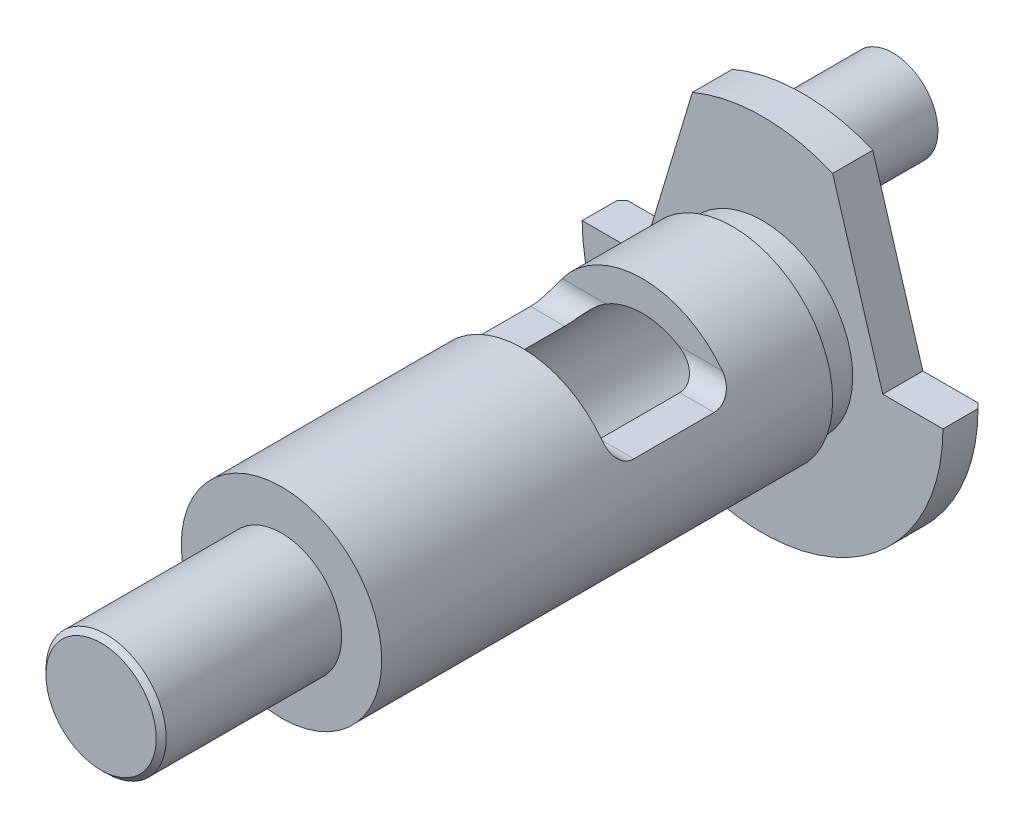
ISO-10303-21;
HEADER;
FILE_DESCRIPTION(('STEP AP214'),'2;1');
FILE_NAME('part.step','',(''),(''),'','','');
FILE_SCHEMA(('AUTOMOTIVE_DESIGN { 1 0 10303 214 1 1 1 1 }'));
ENDSEC;
DATA;
#1=APPLICATION_CONTEXT('core data for automotive mechanical design processes');
#2=APPLICATION_PROTOCOL_DEFINITION('international standard','automotive_design',2000,#1);
#3=PRODUCT_CONTEXT('',#1,'mechanical');
#4=PRODUCT('Part','Part','',(#3));
#5=PRODUCT_RELATED_PRODUCT_CATEGORY('part','',(#4));
#6=PRODUCT_DEFINITION_FORMATION('','',#4);
#7=PRODUCT_DEFINITION_CONTEXT('part definition',#1,'design');
#8=PRODUCT_DEFINITION('design','',#6,#7);
#9=PRODUCT_DEFINITION_SHAPE('','',#8);
#10=(LENGTH_UNIT() NAMED_UNIT(*) SI_UNIT(.MILLI.,.METRE.));
#11=(NAMED_UNIT(*) PLANE_ANGLE_UNIT() SI_UNIT($,.RADIAN.));
#12=(NAMED_UNIT(*) SI_UNIT($,.STERADIAN.) SOLID_ANGLE_UNIT());
#13=UNCERTAINTY_MEASURE_WITH_UNIT(LENGTH_MEASURE(1.E-05),#10,'distance_accuracy_value','');
#14=(GEOMETRIC_REPRESENTATION_CONTEXT(3) GLOBAL_UNCERTAINTY_ASSIGNED_CONTEXT((#13)) GLOBAL_UNIT_ASSIGNED_CONTEXT((#10,
#11,#12)) REPRESENTATION_CONTEXT('',''));
#15=CARTESIAN_POINT('',(0.,0.,0.));
#16=DIRECTION('',(0.,0.,1.));
#17=DIRECTION('',(1.,0.,0.));
#18=AXIS2_PLACEMENT_3D('',#15,#16,#17);
#19=CARTESIAN_POINT('',(0.,8.99999999999999,4.));
#20=DIRECTION('',(0.,0.,1.));
#21=DIRECTION('',(0.,-1.,0.));
#22=AXIS2_PLACEMENT_3D('',#19,#20,#21);
#23=PLANE('',#22);
#24=CARTESIAN_POINT('',(0.,0.,4.));
#25=DIRECTION('',(0.,0.,-1.));
#26=DIRECTION('',(0.,1.,0.));
#27=AXIS2_PLACEMENT_3D('',#24,#25,#26);
#28=CIRCLE('',#27,8.99999999999999);
#29=CARTESIAN_POINT('',(0.,8.99999999999999,4.));
#30=VERTEX_POINT('',#29);
#31=EDGE_CURVE('E188',#30,#30,#28,.T.);
#32=ORIENTED_EDGE('',*,*,#31,.T.);
#33=EDGE_LOOP('',(#32));
#34=FACE_BOUND('',#33,.T.);
#35=CARTESIAN_POINT('',(0.,0.,4.));
#36=DIRECTION('',(0.,0.,-1.));
#37=DIRECTION('',(0.,1.,0.));
#38=AXIS2_PLACEMENT_3D('',#35,#36,#37);
#39=CIRCLE('',#38,18.);
#40=CARTESIAN_POINT('',(18.,0.,4.));
#41=VERTEX_POINT('',#40);
#42=CARTESIAN_POINT('',(-18.,0.,4.));
#43=VERTEX_POINT('',#42);
#44=EDGE_CURVE('E181',#41,#43,#39,.T.);
#45=ORIENTED_EDGE('',*,*,#44,.F.);
#46=DIRECTION('',(-1.,0.,0.));
#47=VECTOR('',#46,1.);
#48=CARTESIAN_POINT('',(0.,0.,4.));
#49=LINE('',#48,#47);
#50=CARTESIAN_POINT('',(12.,0.,4.));
#51=VERTEX_POINT('',#50);
#52=EDGE_CURVE('E512',#41,#51,#49,.T.);
#53=ORIENTED_EDGE('',*,*,#52,.T.);
#54=DIRECTION('',(-0.288675134594813,0.957427107756338,0.));
#55=VECTOR('',#54,1.);
#56=CARTESIAN_POINT('',(8.51253140723345,11.5666247903554,4.));
#57=LINE('',#56,#55);
#58=CARTESIAN_POINT('',(7.,16.583123951777,4.));
#59=VERTEX_POINT('',#58);
#60=EDGE_CURVE('E509',#51,#59,#57,.T.);
#61=ORIENTED_EDGE('',*,*,#60,.T.);
#62=CARTESIAN_POINT('',(-6.99999999999999,16.583123951777,4.));
#63=VERTEX_POINT('',#62);
#64=EDGE_CURVE('E178',#63,#59,#39,.T.);
#65=ORIENTED_EDGE('',*,*,#64,.F.);
#66=DIRECTION('',(-0.288675134594813,-0.957427107756338,0.));
#67=VECTOR('',#66,1.);
#68=CARTESIAN_POINT('',(-8.51253140723345,11.5666247903554,4.));
#69=LINE('',#68,#67);
#70=CARTESIAN_POINT('',(-12.,0.,4.));
#71=VERTEX_POINT('',#70);
#72=EDGE_CURVE('E158',#63,#71,#69,.T.);
#73=ORIENTED_EDGE('',*,*,#72,.T.);
#74=DIRECTION('',(-1.,0.,0.));
#75=VECTOR('',#74,1.);
#76=CARTESIAN_POINT('',(0.,0.,4.));
#77=LINE('',#76,#75);
#78=EDGE_CURVE('E500',#71,#43,#77,.T.);
#79=ORIENTED_EDGE('',*,*,#78,.T.);
#80=EDGE_LOOP('',(#45,#53,#61,#65,#73,#79));
#81=FACE_BOUND('',#80,.T.);
#82=ADVANCED_FACE('F39',(#34,#81),#23,.T.);
#83=CARTESIAN_POINT('',(0.,0.,0.));
#84=DIRECTION('',(0.,0.,-1.));
#85=DIRECTION('',(0.,1.,0.));
#86=AXIS2_PLACEMENT_3D('',#83,#84,#85);
#87=CYLINDRICAL_SURFACE('',#86,18.);
#88=DIRECTION('',(0.,0.,-1.));
#89=VECTOR('',#88,1.);
#90=CARTESIAN_POINT('',(-18.,0.,10.));
#91=LINE('',#90,#89);
#92=CARTESIAN_POINT('',(-18.,0.,0.499999999999999));
#93=VERTEX_POINT('',#92);
#94=EDGE_CURVE('E330',#43,#93,#91,.T.);
#95=ORIENTED_EDGE('',*,*,#94,.T.);
#96=CARTESIAN_POINT('',(0.,0.,0.499999999999999));
#97=DIRECTION('',(0.,0.,-1.));
#98=DIRECTION('',(0.,1.,0.));
#99=AXIS2_PLACEMENT_3D('',#96,#97,#98);
#100=CIRCLE('',#99,18.);
#101=CARTESIAN_POINT('',(18.,0.,0.499999999999999));
#102=VERTEX_POINT('',#101);
#103=EDGE_CURVE('E55',#93,#102,#100,.F.);
#104=ORIENTED_EDGE('',*,*,#103,.T.);
#105=DIRECTION('',(0.,0.,-1.));
#106=VECTOR('',#105,1.);
#107=CARTESIAN_POINT('',(18.,0.,10.));
#108=LINE('',#107,#106);
#109=EDGE_CURVE('E327',#41,#102,#108,.T.);
#110=ORIENTED_EDGE('',*,*,#109,.F.);
#111=ORIENTED_EDGE('',*,*,#44,.T.);
#112=EDGE_LOOP('',(#95,#104,#110,#111));
#113=FACE_BOUND('',#112,.T.);
#114=ADVANCED_FACE('F345',(#113),#87,.T.);
#115=ORIENTED_EDGE('',*,*,#64,.T.);
#116=DIRECTION('',(0.,0.,-1.));
#117=VECTOR('',#116,1.);
#118=CARTESIAN_POINT('',(7.,16.583123951777,10.));
#119=LINE('',#118,#117);
#120=CARTESIAN_POINT('',(7.,16.583123951777,0.));
#121=VERTEX_POINT('',#120);
#122=EDGE_CURVE('E163',#59,#121,#119,.T.);
#123=ORIENTED_EDGE('',*,*,#122,.T.);
#124=CARTESIAN_POINT('',(0.,0.,0.));
#125=DIRECTION('',(0.,0.,-1.));
#126=DIRECTION('',(0.,1.,0.));
#127=AXIS2_PLACEMENT_3D('',#124,#125,#126);
#128=CIRCLE('',#127,18.);
#129=CARTESIAN_POINT('',(-6.99999999999999,16.583123951777,0.));
#130=VERTEX_POINT('',#129);
#131=EDGE_CURVE('E171',#130,#121,#128,.T.);
#132=ORIENTED_EDGE('',*,*,#131,.F.);
#133=DIRECTION('',(0.,0.,-1.));
#134=VECTOR('',#133,1.);
#135=CARTESIAN_POINT('',(-6.99999999999999,16.583123951777,10.));
#136=LINE('',#135,#134);
#137=EDGE_CURVE('E151',#63,#130,#136,.T.);
#138=ORIENTED_EDGE('',*,*,#137,.F.);
#139=EDGE_LOOP('',(#115,#123,#132,#138));
#140=FACE_BOUND('',#139,.T.);
#141=ADVANCED_FACE('F177',(#140),#87,.T.);
#142=CARTESIAN_POINT('',(0.,18.,0.));
#143=DIRECTION('',(0.,0.,-1.));
#144=DIRECTION('',(0.,1.,0.));
#145=AXIS2_PLACEMENT_3D('',#142,#143,#144);
#146=PLANE('',#145);
#147=CARTESIAN_POINT('',(0.,12.5,0.));
#148=DIRECTION('',(0.,0.,-1.));
#149=DIRECTION('',(0.,1.,0.));
#150=AXIS2_PLACEMENT_3D('',#147,#148,#149);
#151=CIRCLE('',#150,5.00000000000002);
#152=CARTESIAN_POINT('',(0.,17.5,0.));
#153=VERTEX_POINT('',#152);
#154=EDGE_CURVE('E315',#153,#153,#151,.F.);
#155=ORIENTED_EDGE('',*,*,#154,.T.);
#156=EDGE_LOOP('',(#155));
#157=FACE_BOUND('',#156,.T.);
#158=CARTESIAN_POINT('',(0.,0.,0.));
#159=DIRECTION('',(0.,0.,-1.));
#160=DIRECTION('',(0.,1.,0.));
#161=AXIS2_PLACEMENT_3D('',#158,#159,#160);
#162=CIRCLE('',#161,7.);
#163=CARTESIAN_POINT('',(0.,7.,0.));
#164=VERTEX_POINT('',#163);
#165=EDGE_CURVE('E179',#164,#164,#162,.T.);
#166=ORIENTED_EDGE('',*,*,#165,.F.);
#167=EDGE_LOOP('',(#166));
#168=FACE_BOUND('',#167,.T.);
#169=DIRECTION('',(1.,0.,0.));
#170=VECTOR('',#169,1.);
#171=CARTESIAN_POINT('',(18.,0.,0.));
#172=LINE('',#171,#170);
#173=CARTESIAN_POINT('',(12.,0.,0.));
#174=VERTEX_POINT('',#173);
#175=CARTESIAN_POINT('',(17.5,0.,0.));
#176=VERTEX_POINT('',#175);
#177=EDGE_CURVE('E325',#174,#176,#172,.T.);
#178=ORIENTED_EDGE('',*,*,#177,.T.);
#179=CARTESIAN_POINT('',(0.,0.,0.));
#180=DIRECTION('',(0.,0.,-1.));
#181=DIRECTION('',(0.,1.,0.));
#182=AXIS2_PLACEMENT_3D('',#179,#180,#181);
#183=CIRCLE('',#182,17.5);
#184=CARTESIAN_POINT('',(-17.5,0.,0.));
#185=VERTEX_POINT('',#184);
#186=EDGE_CURVE('E318',#176,#185,#183,.T.);
#187=ORIENTED_EDGE('',*,*,#186,.T.);
#188=DIRECTION('',(1.,0.,0.));
#189=VECTOR('',#188,1.);
#190=CARTESIAN_POINT('',(-12.,0.,0.));
#191=LINE('',#190,#189);
#192=CARTESIAN_POINT('',(-12.,0.,0.));
#193=VERTEX_POINT('',#192);
#194=EDGE_CURVE('E173',#185,#193,#191,.T.);
#195=ORIENTED_EDGE('',*,*,#194,.T.);
#196=DIRECTION('',(0.288675134594813,0.957427107756338,0.));
#197=VECTOR('',#196,1.);
#198=CARTESIAN_POINT('',(-7.,16.583123951777,0.));
#199=LINE('',#198,#197);
#200=EDGE_CURVE('E155',#193,#130,#199,.T.);
#201=ORIENTED_EDGE('',*,*,#200,.T.);
#202=ORIENTED_EDGE('',*,*,#131,.T.);
#203=DIRECTION('',(0.288675134594813,-0.957427107756338,0.));
#204=VECTOR('',#203,1.);
#205=CARTESIAN_POINT('',(12.,0.,0.));
#206=LINE('',#205,#204);
#207=EDGE_CURVE('E174',#121,#174,#206,.T.);
#208=ORIENTED_EDGE('',*,*,#207,.T.);
#209=EDGE_LOOP('',(#178,#187,#195,#201,#202,#208));
#210=FACE_BOUND('',#209,.T.);
#211=ADVANCED_FACE('F169',(#157,#168,#210),#146,.T.);
#212=CARTESIAN_POINT('',(0.,0.,36.));
#213=DIRECTION('',(0.,0.,-1.));
#214=DIRECTION('',(0.,1.,0.));
#215=AXIS2_PLACEMENT_3D('',#212,#213,#214);
#216=CONICAL_SURFACE('',#215,0.,1.05165021254837);
#217=CARTESIAN_POINT('',(0.,0.,32.));
#218=DIRECTION('',(0.,0.,-1.));
#219=DIRECTION('',(0.,1.,0.));
#220=AXIS2_PLACEMENT_3D('',#217,#218,#219);
#221=CIRCLE('',#220,7.);
#222=CARTESIAN_POINT('',(0.,7.,32.));
#223=VERTEX_POINT('',#222);
#224=EDGE_CURVE('E184',#223,#223,#221,.T.);
#225=ORIENTED_EDGE('',*,*,#224,.T.);
#226=EDGE_LOOP('',(#225));
#227=FACE_BOUND('',#226,.T.);
#228=CARTESIAN_POINT('',(0.,0.,36.));
#229=VERTEX_POINT('',#228);
#230=VERTEX_LOOP('',#229);
#231=FACE_BOUND('',#230,.T.);
#232=ADVANCED_FACE('F397',(#227,#231),#216,.F.);
#233=CARTESIAN_POINT('',(0.,0.,70.));
#234=DIRECTION('',(0.,0.,1.));
#235=DIRECTION('',(0.,-1.,0.));
#236=AXIS2_PLACEMENT_3D('',#233,#234,#235);
#237=PLANE('',#236);
#238=CARTESIAN_POINT('',(0.,0.,70.));
#239=DIRECTION('',(0.,0.,1.));
#240=DIRECTION('',(0.,-1.,0.));
#241=AXIS2_PLACEMENT_3D('',#238,#239,#240);
#242=CIRCLE('',#241,5.49999999999996);
#243=CARTESIAN_POINT('',(0.,-5.49999999999997,70.));
#244=VERTEX_POINT('',#243);
#245=EDGE_CURVE('E312',#244,#244,#242,.T.);
#246=ORIENTED_EDGE('',*,*,#245,.T.);
#247=EDGE_LOOP('',(#246));
#248=FACE_BOUND('',#247,.T.);
#249=ADVANCED_FACE('F389',(#248),#237,.T.);
#250=CARTESIAN_POINT('',(0.,0.,0.));
#251=DIRECTION('',(0.,0.,-1.));
#252=DIRECTION('',(0.,1.,0.));
#253=AXIS2_PLACEMENT_3D('',#250,#251,#252);
#254=CYLINDRICAL_SURFACE('',#253,6.);
#255=CARTESIAN_POINT('',(0.,0.,69.5));
#256=DIRECTION('',(0.,0.,1.));
#257=DIRECTION('',(0.,-1.,0.));
#258=AXIS2_PLACEMENT_3D('',#255,#256,#257);
#259=CIRCLE('',#258,6.);
#260=CARTESIAN_POINT('',(0.,-6.,69.5));
#261=VERTEX_POINT('',#260);
#262=EDGE_CURVE('E309',#261,#261,#259,.F.);
#263=ORIENTED_EDGE('',*,*,#262,.T.);
#264=EDGE_LOOP('',(#263));
#265=FACE_BOUND('',#264,.T.);
#266=CARTESIAN_POINT('',(0.,0.,52.));
#267=DIRECTION('',(0.,0.,-1.));
#268=DIRECTION('',(0.,1.,0.));
#269=AXIS2_PLACEMENT_3D('',#266,#267,#268);
#270=CIRCLE('',#269,6.);
#271=CARTESIAN_POINT('',(0.,5.99999999999999,52.));
#272=VERTEX_POINT('',#271);
#273=EDGE_CURVE('E200',#272,#272,#270,.T.);
#274=ORIENTED_EDGE('',*,*,#273,.F.);
#275=EDGE_LOOP('',(#274));
#276=FACE_BOUND('',#275,.T.);
#277=ADVANCED_FACE('F381',(#265,#276),#254,.T.);
#278=CARTESIAN_POINT('',(0.,5.99999999999999,52.));
#279=DIRECTION('',(0.,0.,1.));
#280=DIRECTION('',(0.,-1.,0.));
#281=AXIS2_PLACEMENT_3D('',#278,#279,#280);
#282=PLANE('',#281);
#283=ORIENTED_EDGE('',*,*,#273,.T.);
#284=EDGE_LOOP('',(#283));
#285=FACE_BOUND('',#284,.T.);
#286=CARTESIAN_POINT('',(0.,0.,52.));
#287=DIRECTION('',(0.,0.,-1.));
#288=DIRECTION('',(0.,1.,0.));
#289=AXIS2_PLACEMENT_3D('',#286,#287,#288);
#290=CIRCLE('',#289,10.);
#291=CARTESIAN_POINT('',(0.,9.99999999999999,52.));
#292=VERTEX_POINT('',#291);
#293=EDGE_CURVE('E197',#292,#292,#290,.T.);
#294=ORIENTED_EDGE('',*,*,#293,.F.);
#295=EDGE_LOOP('',(#294));
#296=FACE_BOUND('',#295,.T.);
#297=ADVANCED_FACE('F259',(#285,#296),#282,.T.);
#298=CARTESIAN_POINT('',(0.,0.,0.));
#299=DIRECTION('',(0.,0.,-1.));
#300=DIRECTION('',(0.,1.,0.));
#301=AXIS2_PLACEMENT_3D('',#298,#299,#300);
#302=CYLINDRICAL_SURFACE('',#301,9.99999999999999);
#303=CARTESIAN_POINT('',(0.,0.,28.));
#304=DIRECTION('',(0.,0.,1.));
#305=DIRECTION('',(1.,0.,0.));
#306=AXIS2_PLACEMENT_3D('',#303,#304,#305);
#307=CIRCLE('',#306,9.99999999999999);
#308=CARTESIAN_POINT('',(-7.99999999999999,6.00000000000001,28.));
#309=VERTEX_POINT('',#308);
#310=CARTESIAN_POINT('',(7.99999999999999,6.00000000000001,28.));
#311=VERTEX_POINT('',#310);
#312=EDGE_CURVE('E246',#309,#311,#307,.F.);
#313=ORIENTED_EDGE('',*,*,#312,.F.);
#314=CARTESIAN_POINT('',(-9.16515138991168,3.99999999999999,26.));
#315=CARTESIAN_POINT('',(-9.16515117183311,3.99999264234156,26.0523308265649));
#316=CARTESIAN_POINT('',(-9.16425496664045,4.00205376138435,26.1046585072529));
#317=CARTESIAN_POINT('',(-9.16067005739488,4.01025694582917,26.2089241873045));
#318=CARTESIAN_POINT('',(-9.15798160024527,4.01639844911103,26.2608622393473));
#319=CARTESIAN_POINT('',(-9.15081977291224,4.03268797715261,26.363863255721));
#320=CARTESIAN_POINT('',(-9.1463504544233,4.04282690669225,26.4149279339174));
#321=CARTESIAN_POINT('',(-9.13563109883409,4.06699124711838,26.5159239359321));
#322=CARTESIAN_POINT('',(-9.12938105685553,4.08101666865189,26.5658552566451));
#323=CARTESIAN_POINT('',(-9.10795685357301,4.12872306426807,26.7134284001006));
#324=CARTESIAN_POINT('',(-9.09010262629201,4.16804823069825,26.8089368590826));
#325=CARTESIAN_POINT('',(-9.04734503409114,4.26005905139115,26.9915026488282));
#326=CARTESIAN_POINT('',(-9.0224400642028,4.31274774732446,27.0785580493463));
#327=CARTESIAN_POINT('',(-8.96516926076698,4.43058754304287,27.2439705403564));
#328=CARTESIAN_POINT('',(-8.93265886592638,4.49597530571394,27.3221087542347));
#329=CARTESIAN_POINT('',(-8.86085839472232,4.63587792882914,27.4660329440522));
#330=CARTESIAN_POINT('',(-8.82156905089418,4.71039180285069,27.5318202530317));
#331=CARTESIAN_POINT('',(-8.7337050665276,4.8714862628894,27.6545152930098));
#332=CARTESIAN_POINT('',(-8.68466859165629,4.95854821418174,27.7104578063826));
#333=CARTESIAN_POINT('',(-8.58017049651171,5.13725940054471,27.8072191919475));
#334=CARTESIAN_POINT('',(-8.52469686398252,5.22891702453962,27.8480091727408));
#335=CARTESIAN_POINT('',(-8.39548924689343,5.43447129881106,27.9221274062072));
#336=CARTESIAN_POINT('',(-8.32041851960716,5.54883725751874,27.9518580806686));
#337=CARTESIAN_POINT('',(-8.2032821451696,5.7193485046504,27.9810505425362));
#338=CARTESIAN_POINT('',(-8.16353999327878,5.77593472661012,27.9882147926944));
#339=CARTESIAN_POINT('',(-8.08272919797198,5.88848713541995,27.997683768442));
#340=CARTESIAN_POINT('',(-8.04166182979912,5.94445385261819,27.9999930322191));
#341=CARTESIAN_POINT('',(-7.99999999999999,6.00000000000001,28.));
#342=B_SPLINE_CURVE_WITH_KNOTS('',3,(#314,#315,#316,#317,#318,#319,#320,#321,#322,#323,#324,
#325,#326,#327,#328,#329,#330,#331,#332,#333,#334,#335,#336,#337,#338,#339,#340,#341),
.UNSPECIFIED.,.F.,.F.,(4,2,2,2,2,2,2,2,2,2,2,2,2,4),(0.,0.156938762205109,0.313855908760739,
0.470418068100073,0.62698065634509,0.939842867153017,1.25277635247853,1.57222617149183,
1.89164149225455,2.23379020068857,2.57658797718782,2.99455494394361,3.2029600514477,
3.41117026596516),.UNSPECIFIED.);
#343=CARTESIAN_POINT('',(-9.16515138991168,3.99999999999999,26.));
#344=VERTEX_POINT('',#343);
#345=EDGE_CURVE('E245',#344,#309,#342,.T.);
#346=ORIENTED_EDGE('',*,*,#345,.F.);
#347=DIRECTION('',(0.,0.,-1.));
#348=VECTOR('',#347,1.);
#349=CARTESIAN_POINT('',(-9.16515138991168,3.99999999999999,0.));
#350=LINE('',#349,#348);
#351=CARTESIAN_POINT('',(-9.16515138991168,3.99999999999999,18.));
#352=VERTEX_POINT('',#351);
#353=EDGE_CURVE('E275',#352,#344,#350,.F.);
#354=ORIENTED_EDGE('',*,*,#353,.F.);
#355=CARTESIAN_POINT('',(-8.,5.99999999999999,16.));
#356=CARTESIAN_POINT('',(-8.05100860734725,5.9320096871119,15.9999993982257));
#357=CARTESIAN_POINT('',(-8.10115365222654,5.86332277570349,16.0034687284791));
#358=CARTESIAN_POINT('',(-8.19942377317649,5.72508416287428,16.0177637267525));
#359=CARTESIAN_POINT('',(-8.24754486313818,5.65553107530451,16.0286032501096));
#360=CARTESIAN_POINT('',(-8.34147945854255,5.51605217330792,16.0581211727836));
#361=CARTESIAN_POINT('',(-8.38728221352922,5.44612603709732,16.0768329025427));
#362=CARTESIAN_POINT('',(-8.47590454553099,5.3071493859085,16.1224200883496));
#363=CARTESIAN_POINT('',(-8.51872679892919,5.23809813211875,16.1492881009843));
#364=CARTESIAN_POINT('',(-8.61870349319011,5.0725573136254,16.2248143929716));
#365=CARTESIAN_POINT('',(-8.67414266859353,4.97698045814652,16.2778768395697));
#366=CARTESIAN_POINT('',(-8.77699348164834,4.79327271198357,16.401245388745));
#367=CARTESIAN_POINT('',(-8.82442593485662,4.70512282178739,16.4715055772984));
#368=CARTESIAN_POINT('',(-8.91083720028691,4.53935888130143,16.6289911443071));
#369=CARTESIAN_POINT('',(-8.94976464838187,4.46180985101523,16.7163138789075));
#370=CARTESIAN_POINT('',(-9.0182142913682,4.32179606710731,16.9057018707625));
#371=CARTESIAN_POINT('',(-9.04773146024579,4.2593393785746,17.0077749640058));
#372=CARTESIAN_POINT('',(-9.09466953671398,4.15810169516961,17.213068894597));
#373=CARTESIAN_POINT('',(-9.11297222672082,4.11763694664432,17.3152625532015));
#374=CARTESIAN_POINT('',(-9.14149760740605,4.05391926931878,17.5258507603887));
#375=CARTESIAN_POINT('',(-9.15173523125053,4.03063453533525,17.6342334483068));
#376=CARTESIAN_POINT('',(-9.16035163835097,4.01098253148704,17.7863275069662));
#377=CARTESIAN_POINT('',(-9.16215309604838,4.00686409758567,17.8289740090886));
#378=CARTESIAN_POINT('',(-9.16455116975046,4.0013760840502,17.9144064763021));
#379=CARTESIAN_POINT('',(-9.1651497718668,4.00000197311215,17.9571920944665));
#380=CARTESIAN_POINT('',(-9.16515138991168,3.99999999999999,18.));
#381=B_SPLINE_CURVE_WITH_KNOTS('',3,(#355,#356,#357,#358,#359,#360,#361,#362,#363,#364,#365,
#366,#367,#368,#369,#370,#371,#372,#373,#374,#375,#376,#377,#378,#379,#380),.UNSPECIFIED.,.F.,
.F.,(4,2,2,2,2,2,2,2,2,2,2,2,4),(0.,0.254972115430074,0.51042488690115,0.766970291028312,
1.02328227241889,1.38935419811023,1.75445925631581,2.12171181168203,2.48916018866136,
2.82175586610571,3.15373425696246,3.28229982324811,3.4106529317057),.UNSPECIFIED.);
#382=CARTESIAN_POINT('',(-8.,5.99999999999999,16.));
#383=VERTEX_POINT('',#382);
#384=EDGE_CURVE('E274',#383,#352,#381,.T.);
#385=ORIENTED_EDGE('',*,*,#384,.F.);
#386=CARTESIAN_POINT('',(0.,0.,16.));
#387=DIRECTION('',(0.,0.,-1.));
#388=DIRECTION('',(-1.,0.,0.));
#389=AXIS2_PLACEMENT_3D('',#386,#387,#388);
#390=CIRCLE('',#389,9.99999999999999);
#391=CARTESIAN_POINT('',(8.,5.99999999999999,16.));
#392=VERTEX_POINT('',#391);
#393=EDGE_CURVE('E569',#392,#383,#390,.F.);
#394=ORIENTED_EDGE('',*,*,#393,.F.);
#395=CARTESIAN_POINT('',(9.16515138991168,3.99999999999999,18.));
#396=CARTESIAN_POINT('',(9.16515117183311,3.99999264234156,17.9476691734351));
#397=CARTESIAN_POINT('',(9.16425496664045,4.00205376138435,17.8953414927471));
#398=CARTESIAN_POINT('',(9.16067005739488,4.01025694582917,17.7910758126955));
#399=CARTESIAN_POINT('',(9.15798160024527,4.01639844911103,17.7391377606527));
#400=CARTESIAN_POINT('',(9.15081977291224,4.03268797715261,17.636136744279));
#401=CARTESIAN_POINT('',(9.1463504544233,4.04282690669225,17.5850720660826));
#402=CARTESIAN_POINT('',(9.13563109883409,4.06699124711837,17.4840760640679));
#403=CARTESIAN_POINT('',(9.12938105685553,4.08101666865189,17.4341447433549));
#404=CARTESIAN_POINT('',(9.10795685357301,4.12872306426807,17.2865715998994));
#405=CARTESIAN_POINT('',(9.09010262629201,4.16804823069825,17.1910631409174));
#406=CARTESIAN_POINT('',(9.04734503409114,4.26005905139115,17.0084973511718));
#407=CARTESIAN_POINT('',(9.0224400642028,4.31274774732446,16.9214419506537));
#408=CARTESIAN_POINT('',(8.96516926076698,4.43058754304287,16.7560294596436));
#409=CARTESIAN_POINT('',(8.93265886592638,4.49597530571395,16.6778912457653));
#410=CARTESIAN_POINT('',(8.86085839472232,4.63587792882914,16.5339670559478));
#411=CARTESIAN_POINT('',(8.82156905089418,4.7103918028507,16.4681797469683));
#412=CARTESIAN_POINT('',(8.7337050665276,4.8714862628894,16.3454847069902));
#413=CARTESIAN_POINT('',(8.68466859165629,4.95854821418174,16.2895421936174));
#414=CARTESIAN_POINT('',(8.58017049651171,5.13725940054471,16.1927808080525));
#415=CARTESIAN_POINT('',(8.52469686398251,5.22891702453962,16.1519908272592));
#416=CARTESIAN_POINT('',(8.39548924689343,5.43447129881106,16.0778725937928));
#417=CARTESIAN_POINT('',(8.32041851960717,5.54883725751873,16.0481419193314));
#418=CARTESIAN_POINT('',(8.2032821451696,5.71934850465039,16.0189494574638));
#419=CARTESIAN_POINT('',(8.16353999327879,5.77593472661011,16.0117852073056));
#420=CARTESIAN_POINT('',(8.08272919797199,5.88848713541994,16.002316231558));
#421=CARTESIAN_POINT('',(8.04166182979912,5.94445385261818,16.0000069677809));
#422=CARTESIAN_POINT('',(8.,5.99999999999999,16.));
#423=B_SPLINE_CURVE_WITH_KNOTS('',3,(#395,#396,#397,#398,#399,#400,#401,#402,#403,#404,#405,
#406,#407,#408,#409,#410,#411,#412,#413,#414,#415,#416,#417,#418,#419,#420,#421,#422),
.UNSPECIFIED.,.F.,.F.,(4,2,2,2,2,2,2,2,2,2,2,2,2,4),(0.,0.156938762205106,0.313855908760735,
0.470418068100069,0.62698065634509,0.939842867153017,1.25277635247853,1.57222617149183,
1.89164149225456,2.23379020068857,2.57658797718782,2.9945549439436,3.20296005144769,
3.41117026596515),.UNSPECIFIED.);
#424=CARTESIAN_POINT('',(9.16515138991168,3.99999999999999,18.));
#425=VERTEX_POINT('',#424);
#426=EDGE_CURVE('E268',#425,#392,#423,.T.);
#427=ORIENTED_EDGE('',*,*,#426,.F.);
#428=DIRECTION('',(0.,0.,-1.));
#429=VECTOR('',#428,1.);
#430=CARTESIAN_POINT('',(9.16515138991168,3.99999999999999,0.));
#431=LINE('',#430,#429);
#432=CARTESIAN_POINT('',(9.16515138991168,3.99999999999999,26.));
#433=VERTEX_POINT('',#432);
#434=EDGE_CURVE('E560',#433,#425,#431,.T.);
#435=ORIENTED_EDGE('',*,*,#434,.F.);
#436=CARTESIAN_POINT('',(7.99999999999999,6.00000000000001,28.));
#437=CARTESIAN_POINT('',(8.05100860734723,5.93200968711191,28.0000006017743));
#438=CARTESIAN_POINT('',(8.10115365222653,5.8633227757035,27.9965312715209));
#439=CARTESIAN_POINT('',(8.19942377317648,5.72508416287429,27.9822362732475));
#440=CARTESIAN_POINT('',(8.24754486313818,5.65553107530453,27.9713967498904));
#441=CARTESIAN_POINT('',(8.34147945854254,5.51605217330794,27.9418788272164));
#442=CARTESIAN_POINT('',(8.38728221352921,5.44612603709733,27.9231670974573));
#443=CARTESIAN_POINT('',(8.47590454553097,5.30714938590851,27.8775799116504));
#444=CARTESIAN_POINT('',(8.51872679892918,5.23809813211877,27.8507118990157));
#445=CARTESIAN_POINT('',(8.6187034931901,5.07255731362541,27.7751856070284));
#446=CARTESIAN_POINT('',(8.67414266859352,4.97698045814652,27.7221231604303));
#447=CARTESIAN_POINT('',(8.77699348164833,4.79327271198358,27.598754611255));
#448=CARTESIAN_POINT('',(8.82442593485662,4.70512282178739,27.5284944227016));
#449=CARTESIAN_POINT('',(8.91083720028691,4.53935888130144,27.3710088556929));
#450=CARTESIAN_POINT('',(8.94976464838187,4.46180985101524,27.2836861210925));
#451=CARTESIAN_POINT('',(9.0182142913682,4.32179606710731,27.0942981292375));
#452=CARTESIAN_POINT('',(9.04773146024579,4.25933937857461,26.9922250359942));
#453=CARTESIAN_POINT('',(9.09466953671398,4.15810169516961,26.786931105403));
#454=CARTESIAN_POINT('',(9.11297222672082,4.11763694664432,26.6847374467985));
#455=CARTESIAN_POINT('',(9.14149760740605,4.05391926931878,26.4741492396114));
#456=CARTESIAN_POINT('',(9.15173523125052,4.03063453533525,26.3657665516932));
#457=CARTESIAN_POINT('',(9.16035163835097,4.01098253148704,26.2136724930338));
#458=CARTESIAN_POINT('',(9.16215309604838,4.00686409758567,26.1710259909114));
#459=CARTESIAN_POINT('',(9.16455116975046,4.0013760840502,26.0855935236979));
#460=CARTESIAN_POINT('',(9.1651497718668,4.00000197311215,26.0428079055335));
#461=CARTESIAN_POINT('',(9.16515138991168,3.99999999999999,26.));
#462=B_SPLINE_CURVE_WITH_KNOTS('',3,(#436,#437,#438,#439,#440,#441,#442,#443,#444,#445,#446,
#447,#448,#449,#450,#451,#452,#453,#454,#455,#456,#457,#458,#459,#460,#461),.UNSPECIFIED.,.F.,
.F.,(4,2,2,2,2,2,2,2,2,2,2,2,4),(0.,0.254972115430076,0.510424886901151,0.766970291028312,
1.02328227241889,1.38935419811024,1.75445925631581,2.12171181168203,2.48916018866137,
2.82175586610572,3.15373425696247,3.28229982324812,3.41065293170572),.UNSPECIFIED.);
#463=EDGE_CURVE('E238',#311,#433,#462,.T.);
#464=ORIENTED_EDGE('',*,*,#463,.F.);
#465=EDGE_LOOP('',(#313,#346,#354,#385,#394,#427,#435,#464));
#466=FACE_BOUND('',#465,.T.);
#467=ORIENTED_EDGE('',*,*,#293,.T.);
#468=EDGE_LOOP('',(#467));
#469=FACE_BOUND('',#468,.T.);
#470=CARTESIAN_POINT('',(0.,0.,7.));
#471=DIRECTION('',(0.,0.,-1.));
#472=DIRECTION('',(0.,1.,0.));
#473=AXIS2_PLACEMENT_3D('',#470,#471,#472);
#474=CIRCLE('',#473,9.99999999999999);
#475=CARTESIAN_POINT('',(0.,9.99999999999999,7.));
#476=VERTEX_POINT('',#475);
#477=EDGE_CURVE('E194',#476,#476,#474,.T.);
#478=ORIENTED_EDGE('',*,*,#477,.F.);
#479=EDGE_LOOP('',(#478));
#480=FACE_BOUND('',#479,.T.);
#481=ADVANCED_FACE('F253',(#466,#469,#480),#302,.T.);
#482=CARTESIAN_POINT('',(0.,9.99999999999999,7.));
#483=DIRECTION('',(0.,0.,-1.));
#484=DIRECTION('',(0.,1.,0.));
#485=AXIS2_PLACEMENT_3D('',#482,#483,#484);
#486=PLANE('',#485);
#487=ORIENTED_EDGE('',*,*,#477,.T.);
#488=EDGE_LOOP('',(#487));
#489=FACE_BOUND('',#488,.T.);
#490=CARTESIAN_POINT('',(0.,0.,7.));
#491=DIRECTION('',(0.,0.,-1.));
#492=DIRECTION('',(0.,1.,0.));
#493=AXIS2_PLACEMENT_3D('',#490,#491,#492);
#494=CIRCLE('',#493,8.99999999999999);
#495=CARTESIAN_POINT('',(0.,8.99999999999999,7.));
#496=VERTEX_POINT('',#495);
#497=EDGE_CURVE('E191',#496,#496,#494,.T.);
#498=ORIENTED_EDGE('',*,*,#497,.F.);
#499=EDGE_LOOP('',(#498));
#500=FACE_BOUND('',#499,.T.);
#501=ADVANCED_FACE('F258',(#489,#500),#486,.T.);
#502=CARTESIAN_POINT('',(0.,0.,0.));
#503=DIRECTION('',(0.,0.,-1.));
#504=DIRECTION('',(0.,1.,0.));
#505=AXIS2_PLACEMENT_3D('',#502,#503,#504);
#506=CYLINDRICAL_SURFACE('',#505,8.99999999999999);
#507=ORIENTED_EDGE('',*,*,#497,.T.);
#508=EDGE_LOOP('',(#507));
#509=FACE_BOUND('',#508,.T.);
#510=ORIENTED_EDGE('',*,*,#31,.F.);
#511=EDGE_LOOP('',(#510));
#512=FACE_BOUND('',#511,.T.);
#513=ADVANCED_FACE('F353',(#509,#512),#506,.T.);
#514=CARTESIAN_POINT('',(0.,0.,0.));
#515=DIRECTION('',(0.,0.,-1.));
#516=DIRECTION('',(0.,1.,0.));
#517=AXIS2_PLACEMENT_3D('',#514,#515,#516);
#518=CYLINDRICAL_SURFACE('',#517,7.);
#519=CARTESIAN_POINT('',(0.,0.,16.));
#520=DIRECTION('',(0.,0.,-1.));
#521=DIRECTION('',(-1.,0.,0.));
#522=AXIS2_PLACEMENT_3D('',#519,#520,#521);
#523=CIRCLE('',#522,7.);
#524=CARTESIAN_POINT('',(-3.60555127546401,5.99999999999999,16.));
#525=VERTEX_POINT('',#524);
#526=CARTESIAN_POINT('',(3.60555127546401,5.99999999999999,16.));
#527=VERTEX_POINT('',#526);
#528=EDGE_CURVE('E307',#525,#527,#523,.T.);
#529=ORIENTED_EDGE('',*,*,#528,.F.);
#530=CARTESIAN_POINT('',(-5.74456264653804,3.99999999999999,18.));
#531=CARTESIAN_POINT('',(-5.74456395739624,3.9999912690224,17.9521072018173));
#532=CARTESIAN_POINT('',(-5.74336481366963,4.00172008399424,17.9042181933505));
#533=CARTESIAN_POINT('',(-5.73857681057154,4.00858681048308,17.8088167769062));
#534=CARTESIAN_POINT('',(-5.7349885323831,4.01372389290075,17.7613042801819));
#535=CARTESIAN_POINT('',(-5.72545090585905,4.02731633277173,17.66717360582));
#536=CARTESIAN_POINT('',(-5.719510235107,4.03575949339295,17.6205527941813));
#537=CARTESIAN_POINT('',(-5.70529577654532,4.05582920093227,17.5283766647713));
#538=CARTESIAN_POINT('',(-5.69702193925206,4.0674558153674,17.4828213696204));
#539=CARTESIAN_POINT('',(-5.66874757903506,4.10686714650466,17.3482705296767));
#540=CARTESIAN_POINT('',(-5.64528172342669,4.13920172817476,17.2612663388019));
#541=CARTESIAN_POINT('',(-5.58953490597339,4.21417455270276,17.0949163133744));
#542=CARTESIAN_POINT('',(-5.55724989312687,4.25681752959232,17.0155740209715));
#543=CARTESIAN_POINT('',(-5.4831491610537,4.35187528789755,16.863330727687));
#544=CARTESIAN_POINT('',(-5.44103528724803,4.40458369493129,16.7907592212947));
#545=CARTESIAN_POINT('',(-5.34882597720007,4.51611660865905,16.6562203333129));
#546=CARTESIAN_POINT('',(-5.29872710476223,4.57494374463055,16.5942575409057));
#547=CARTESIAN_POINT('',(-5.16947774158056,4.72117045758798,16.4578364756714));
#548=CARTESIAN_POINT('',(-5.08683112566817,4.81040666125222,16.3886500077652));
#549=CARTESIAN_POINT('',(-4.91008478408789,4.99069901803833,16.2699634531927));
#550=CARTESIAN_POINT('',(-4.81596037985183,5.08175872791528,16.2205067982603));
#551=CARTESIAN_POINT('',(-4.64678263995699,5.23608484037194,16.1502870282632));
#552=CARTESIAN_POINT('',(-4.57389321774731,5.29990809898265,16.1253641327835));
#553=CARTESIAN_POINT('',(-4.42420660418334,5.42549164241417,16.0831461624526));
#554=CARTESIAN_POINT('',(-4.34740730827439,5.48725078592318,16.0658552451091));
#555=CARTESIAN_POINT('',(-4.11207146301772,5.66832478707963,16.0237981156182));
#556=CARTESIAN_POINT('',(-3.94850603225307,5.78351968974505,16.0088132102133));
#557=CARTESIAN_POINT('',(-3.75149576891143,5.90994718935529,16.0019427559895));
#558=CARTESIAN_POINT('',(-3.72246093644102,5.92827738436944,16.0012044978374));
#559=CARTESIAN_POINT('',(-3.66418008592681,5.964473956251,16.0002335448968));
#560=CARTESIAN_POINT('',(-3.63493464370734,5.98234123127444,15.9999997852162));
#561=CARTESIAN_POINT('',(-3.60555127546401,5.99999999999999,16.));
#562=B_SPLINE_CURVE_WITH_KNOTS('',3,(#530,#531,#532,#533,#534,#535,#536,#537,#538,#539,#540,
#541,#542,#543,#544,#545,#546,#547,#548,#549,#550,#551,#552,#553,#554,#555,#556,#557,#558,#559,
#560,#561),.UNSPECIFIED.,.F.,.F.,(4,2,2,2,2,2,2,2,2,2,2,2,2,2,2,4),(0.,0.143625771782515,
0.287216617787313,0.430282643082836,0.573351702863238,0.859117671972935,1.1450151265141,
1.44108176204024,1.73727615004542,2.15474779837939,2.57313343256408,2.8728388076333,
3.17270724582121,3.77206419367062,3.87510243592869,3.97792297214892),.UNSPECIFIED.);
#563=CARTESIAN_POINT('',(-5.74456264653804,3.99999999999999,18.));
#564=VERTEX_POINT('',#563);
#565=EDGE_CURVE('E293',#564,#525,#562,.T.);
#566=ORIENTED_EDGE('',*,*,#565,.F.);
#567=DIRECTION('',(0.,0.,-1.));
#568=VECTOR('',#567,1.);
#569=CARTESIAN_POINT('',(-5.74456264653804,3.99999999999999,0.));
#570=LINE('',#569,#568);
#571=CARTESIAN_POINT('',(-5.74456264653804,3.99999999999999,26.));
#572=VERTEX_POINT('',#571);
#573=EDGE_CURVE('E546',#572,#564,#570,.T.);
#574=ORIENTED_EDGE('',*,*,#573,.F.);
#575=CARTESIAN_POINT('',(-3.60555127546398,6.00000000000001,28.));
#576=CARTESIAN_POINT('',(-3.70755190220598,5.9387329935433,27.9999691426322));
#577=CARTESIAN_POINT('',(-3.80805137793991,5.87477355515046,27.9971788706329));
#578=CARTESIAN_POINT('',(-4.00576923521183,5.74177528480111,27.984399412456));
#579=CARTESIAN_POINT('',(-4.10297158250475,5.67271572056948,27.9743792060938));
#580=CARTESIAN_POINT('',(-4.29414987915286,5.52944271837615,27.945244423526));
#581=CARTESIAN_POINT('',(-4.38806796688928,5.45517424905925,27.9260140962841));
#582=CARTESIAN_POINT('',(-4.57011586626604,5.30358694827468,27.8765279801898));
#583=CARTESIAN_POINT('',(-4.65825684964817,5.22627449658854,27.8462942594199));
#584=CARTESIAN_POINT('',(-4.83398512361373,5.06437226026307,27.7700783510154));
#585=CARTESIAN_POINT('',(-4.92104588946858,4.97966820381641,27.7230939442019));
#586=CARTESIAN_POINT('',(-5.08498320917749,4.81213356476992,27.6121512784971));
#587=CARTESIAN_POINT('',(-5.16189781072967,4.72929700828366,27.5482593003485));
#588=CARTESIAN_POINT('',(-5.30469883781686,4.56857133575474,27.4010600725461));
#589=CARTESIAN_POINT('',(-5.37043950048019,4.49075478431506,27.3175257829649));
#590=CARTESIAN_POINT('',(-5.45813578256463,4.38302820321117,27.17850138587));
#591=CARTESIAN_POINT('',(-5.48556279890795,4.34859991776009,27.1298372389949));
#592=CARTESIAN_POINT('',(-5.53657238950482,4.28346448739372,27.0281733804973));
#593=CARTESIAN_POINT('',(-5.56015592373646,4.25275641378256,26.9751747564696));
#594=CARTESIAN_POINT('',(-5.60013211213683,4.19993526040025,26.8732524300318));
#595=CARTESIAN_POINT('',(-5.61707160908513,4.17722155172675,26.8248524489374));
#596=CARTESIAN_POINT('',(-5.64787993354287,4.13547155849595,26.7255564975638));
#597=CARTESIAN_POINT('',(-5.66174936936747,4.11643454551777,26.6746610241979));
#598=CARTESIAN_POINT('',(-5.68631698520221,4.08243062040584,26.5708806171931));
#599=CARTESIAN_POINT('',(-5.69702022445898,4.0674572182494,26.5179990112638));
#600=CARTESIAN_POINT('',(-5.71522127202602,4.04184263000406,26.4106841046948));
#601=CARTESIAN_POINT('',(-5.72272079625584,4.03119912495515,26.356251651401));
#602=CARTESIAN_POINT('',(-5.73391808908986,4.0152550913869,26.2516172389729));
#603=CARTESIAN_POINT('',(-5.73791119956913,4.00954044159089,26.2015094593752));
#604=CARTESIAN_POINT('',(-5.74323247250418,4.00191011564273,26.1009360982872));
#605=CARTESIAN_POINT('',(-5.7445643463982,3.99998914875317,26.0504711137427));
#606=CARTESIAN_POINT('',(-5.74456264653804,3.99999999999999,26.));
#607=B_SPLINE_CURVE_WITH_KNOTS('',3,(#575,#576,#577,#578,#579,#580,#581,#582,#583,#584,#585,
#586,#587,#588,#589,#590,#591,#592,#593,#594,#595,#596,#597,#598,#599,#600,#601,#602,#603,#604,
#605,#606),.UNSPECIFIED.,.F.,.F.,(4,2,2,2,2,2,2,2,2,2,2,2,2,2,2,4),(0.,0.357039762700279,
0.715620591012602,1.07883121608528,1.4413173750221,1.83070447855544,2.21858716376349,
2.6111951386031,2.80775068768575,3.00425706803094,3.17226499785614,3.34023960800672,
3.50794434443644,3.6755591447339,3.82711916732992,3.97846767194919),.UNSPECIFIED.);
#608=CARTESIAN_POINT('',(-3.60555127546398,6.00000000000001,28.));
#609=VERTEX_POINT('',#608);
#610=EDGE_CURVE('E205',#609,#572,#607,.T.);
#611=ORIENTED_EDGE('',*,*,#610,.F.);
#612=CARTESIAN_POINT('',(0.,0.,28.));
#613=DIRECTION('',(0.,0.,1.));
#614=DIRECTION('',(1.,0.,0.));
#615=AXIS2_PLACEMENT_3D('',#612,#613,#614);
#616=CIRCLE('',#615,7.);
#617=CARTESIAN_POINT('',(3.60555127546398,6.00000000000001,28.));
#618=VERTEX_POINT('',#617);
#619=EDGE_CURVE('E203',#618,#609,#616,.T.);
#620=ORIENTED_EDGE('',*,*,#619,.F.);
#621=CARTESIAN_POINT('',(5.74456264653804,3.99999999999999,26.));
#622=CARTESIAN_POINT('',(5.74456395739623,3.9999912690224,26.0478927981827));
#623=CARTESIAN_POINT('',(5.74336481366963,4.00172008399424,26.0957818066495));
#624=CARTESIAN_POINT('',(5.73857681057154,4.00858681048308,26.1911832230938));
#625=CARTESIAN_POINT('',(5.7349885323831,4.01372389290075,26.2386957198181));
#626=CARTESIAN_POINT('',(5.72545090585905,4.02731633277173,26.33282639418));
#627=CARTESIAN_POINT('',(5.719510235107,4.03575949339295,26.3794472058187));
#628=CARTESIAN_POINT('',(5.70529577654532,4.05582920093227,26.4716233352287));
#629=CARTESIAN_POINT('',(5.69702193925206,4.0674558153674,26.5171786303796));
#630=CARTESIAN_POINT('',(5.66874757903506,4.10686714650466,26.6517294703233));
#631=CARTESIAN_POINT('',(5.64528172342669,4.13920172817476,26.7387336611981));
#632=CARTESIAN_POINT('',(5.58953490597339,4.21417455270276,26.9050836866256));
#633=CARTESIAN_POINT('',(5.55724989312687,4.25681752959232,26.9844259790285));
#634=CARTESIAN_POINT('',(5.4831491610537,4.35187528789755,27.136669272313));
#635=CARTESIAN_POINT('',(5.44103528724803,4.40458369493128,27.2092407787053));
#636=CARTESIAN_POINT('',(5.34882597720007,4.51611660865904,27.3437796666871));
#637=CARTESIAN_POINT('',(5.29872710476223,4.57494374463055,27.4057424590943));
#638=CARTESIAN_POINT('',(5.16947774158056,4.72117045758798,27.5421635243286));
#639=CARTESIAN_POINT('',(5.08683112566818,4.81040666125222,27.6113499922348));
#640=CARTESIAN_POINT('',(4.9100847840879,4.99069901803832,27.7300365468073));
#641=CARTESIAN_POINT('',(4.81596037985183,5.08175872791528,27.7794932017397));
#642=CARTESIAN_POINT('',(4.64678263995699,5.23608484037194,27.8497129717368));
#643=CARTESIAN_POINT('',(4.57389321774732,5.29990809898265,27.8746358672165));
#644=CARTESIAN_POINT('',(4.42420660418334,5.42549164241416,27.9168538375473));
#645=CARTESIAN_POINT('',(4.34740730827439,5.48725078592317,27.9341447548909));
#646=CARTESIAN_POINT('',(4.11207146301772,5.66832478707962,27.9762018843818));
#647=CARTESIAN_POINT('',(3.94850603225307,5.78351968974504,27.9911867897867));
#648=CARTESIAN_POINT('',(3.75149576891144,5.90994718935529,27.9980572440105));
#649=CARTESIAN_POINT('',(3.72246093644101,5.92827738436944,27.9987955021626));
#650=CARTESIAN_POINT('',(3.66418008592679,5.96447395625101,27.9997664551032));
#651=CARTESIAN_POINT('',(3.63493464370732,5.98234123127445,28.0000002147838));
#652=CARTESIAN_POINT('',(3.60555127546398,6.00000000000001,28.));
#653=B_SPLINE_CURVE_WITH_KNOTS('',3,(#621,#622,#623,#624,#625,#626,#627,#628,#629,#630,#631,
#632,#633,#634,#635,#636,#637,#638,#639,#640,#641,#642,#643,#644,#645,#646,#647,#648,#649,#650,
#651,#652),.UNSPECIFIED.,.F.,.F.,(4,2,2,2,2,2,2,2,2,2,2,2,2,2,2,4),(0.,0.143625771782519,
0.287216617787313,0.430282643082833,0.573351702863238,0.859117671972935,1.1450151265141,
1.44108176204024,1.73727615004541,2.15474779837939,2.57313343256407,2.87283880763329,
3.17270724582121,3.77206419367061,3.8751024359287,3.97792297214894),.UNSPECIFIED.);
#654=CARTESIAN_POINT('',(5.74456264653804,3.99999999999999,26.));
#655=VERTEX_POINT('',#654);
#656=EDGE_CURVE('E213',#655,#618,#653,.T.);
#657=ORIENTED_EDGE('',*,*,#656,.F.);
#658=DIRECTION('',(0.,0.,-1.));
#659=VECTOR('',#658,1.);
#660=CARTESIAN_POINT('',(5.74456264653804,3.99999999999999,0.));
#661=LINE('',#660,#659);
#662=CARTESIAN_POINT('',(5.74456264653804,3.99999999999999,18.));
#663=VERTEX_POINT('',#662);
#664=EDGE_CURVE('E550',#663,#655,#661,.F.);
#665=ORIENTED_EDGE('',*,*,#664,.F.);
#666=CARTESIAN_POINT('',(3.60555127546401,5.99999999999999,16.));
#667=CARTESIAN_POINT('',(3.70755190220601,5.93873299354329,16.0000308573677));
#668=CARTESIAN_POINT('',(3.80805137793994,5.87477355515044,16.0028211293671));
#669=CARTESIAN_POINT('',(4.00576923521185,5.7417752848011,16.015600587544));
#670=CARTESIAN_POINT('',(4.10297158250477,5.67271572056946,16.0256207939062));
#671=CARTESIAN_POINT('',(4.29414987915287,5.52944271837614,16.0547555764739));
#672=CARTESIAN_POINT('',(4.3880679668893,5.45517424905924,16.0739859037159));
#673=CARTESIAN_POINT('',(4.57011586626605,5.30358694827467,16.1234720198102));
#674=CARTESIAN_POINT('',(4.65825684964818,5.22627449658853,16.1537057405801));
#675=CARTESIAN_POINT('',(4.83398512361374,5.06437226026306,16.2299216489846));
#676=CARTESIAN_POINT('',(4.92104588946859,4.9796682038164,16.2769060557981));
#677=CARTESIAN_POINT('',(5.0849832091775,4.81213356476992,16.3878487215029));
#678=CARTESIAN_POINT('',(5.16189781072968,4.72929700828365,16.4517406996515));
#679=CARTESIAN_POINT('',(5.30469883781687,4.56857133575474,16.5989399274539));
#680=CARTESIAN_POINT('',(5.3704395004802,4.49075478431505,16.6824742170351));
#681=CARTESIAN_POINT('',(5.45813578256463,4.38302820321117,16.82149861413));
#682=CARTESIAN_POINT('',(5.48556279890796,4.34859991776009,16.8701627610051));
#683=CARTESIAN_POINT('',(5.53657238950483,4.28346448739371,16.9718266195027));
#684=CARTESIAN_POINT('',(5.56015592373646,4.25275641378255,17.0248252435304));
#685=CARTESIAN_POINT('',(5.60013211213684,4.19993526040025,17.1267475699682));
#686=CARTESIAN_POINT('',(5.61707160908513,4.17722155172675,17.1751475510626));
#687=CARTESIAN_POINT('',(5.64787993354287,4.13547155849594,17.2744435024362));
#688=CARTESIAN_POINT('',(5.66174936936747,4.11643454551777,17.3253389758021));
#689=CARTESIAN_POINT('',(5.68631698520221,4.08243062040584,17.4291193828069));
#690=CARTESIAN_POINT('',(5.69702022445898,4.06745721824939,17.4820009887362));
#691=CARTESIAN_POINT('',(5.71522127202602,4.04184263000406,17.5893158953052));
#692=CARTESIAN_POINT('',(5.72272079625584,4.03119912495514,17.643748348599));
#693=CARTESIAN_POINT('',(5.73391808908986,4.0152550913869,17.7483827610271));
#694=CARTESIAN_POINT('',(5.73791119956913,4.00954044159089,17.7984905406248));
#695=CARTESIAN_POINT('',(5.74323247250418,4.00191011564273,17.8990639017128));
#696=CARTESIAN_POINT('',(5.7445643463982,3.99998914875317,17.9495288862573));
#697=CARTESIAN_POINT('',(5.74456264653804,3.99999999999999,18.));
#698=B_SPLINE_CURVE_WITH_KNOTS('',3,(#666,#667,#668,#669,#670,#671,#672,#673,#674,#675,#676,
#677,#678,#679,#680,#681,#682,#683,#684,#685,#686,#687,#688,#689,#690,#691,#692,#693,#694,#695,
#696,#697),.UNSPECIFIED.,.F.,.F.,(4,2,2,2,2,2,2,2,2,2,2,2,2,2,2,4),(0.,0.357039762700276,
0.715620591012595,1.07883121608527,1.44131737502208,1.83070447855543,2.21858716376348,
2.61119513860308,2.80775068768573,3.00425706803092,3.17226499785612,3.3402396080067,
3.50794434443642,3.67555914473388,3.82711916732989,3.97846767194915),.UNSPECIFIED.);
#699=EDGE_CURVE('E301',#527,#663,#698,.T.);
#700=ORIENTED_EDGE('',*,*,#699,.F.);
#701=EDGE_LOOP('',(#529,#566,#574,#611,#620,#657,#665,#700));
#702=FACE_BOUND('',#701,.T.);
#703=ORIENTED_EDGE('',*,*,#165,.T.);
#704=EDGE_LOOP('',(#703));
#705=FACE_BOUND('',#704,.T.);
#706=ORIENTED_EDGE('',*,*,#224,.F.);
#707=EDGE_LOOP('',(#706));
#708=FACE_BOUND('',#707,.T.);
#709=ADVANCED_FACE('F219',(#702,#705,#708),#518,.F.);
#710=CARTESIAN_POINT('',(-18.,5.99999999999999,18.));
#711=DIRECTION('',(1.,0.,0.));
#712=DIRECTION('',(0.,0.,-1.));
#713=AXIS2_PLACEMENT_3D('',#710,#711,#712);
#714=CYLINDRICAL_SURFACE('',#713,2.);
#715=ORIENTED_EDGE('',*,*,#426,.T.);
#716=DIRECTION('',(1.,0.,0.));
#717=VECTOR('',#716,1.);
#718=CARTESIAN_POINT('',(-18.,5.99999999999999,16.));
#719=LINE('',#718,#717);
#720=EDGE_CURVE('E516',#527,#392,#719,.T.);
#721=ORIENTED_EDGE('',*,*,#720,.F.);
#722=ORIENTED_EDGE('',*,*,#699,.T.);
#723=DIRECTION('',(1.,0.,0.));
#724=VECTOR('',#723,1.);
#725=CARTESIAN_POINT('',(-18.,3.99999999999999,18.));
#726=LINE('',#725,#724);
#727=EDGE_CURVE('E521',#663,#425,#726,.T.);
#728=ORIENTED_EDGE('',*,*,#727,.T.);
#729=EDGE_LOOP('',(#715,#721,#722,#728));
#730=FACE_BOUND('',#729,.T.);
#731=ADVANCED_FACE('F287',(#730),#714,.F.);
#732=CARTESIAN_POINT('',(-18.,3.99999999999999,26.));
#733=DIRECTION('',(0.,-1.,0.));
#734=DIRECTION('',(0.,0.,-1.));
#735=AXIS2_PLACEMENT_3D('',#732,#733,#734);
#736=PLANE('',#735);
#737=ORIENTED_EDGE('',*,*,#353,.T.);
#738=DIRECTION('',(1.,0.,0.));
#739=VECTOR('',#738,1.);
#740=CARTESIAN_POINT('',(-18.,3.99999999999999,26.));
#741=LINE('',#740,#739);
#742=EDGE_CURVE('E524',#344,#572,#741,.T.);
#743=ORIENTED_EDGE('',*,*,#742,.T.);
#744=ORIENTED_EDGE('',*,*,#573,.T.);
#745=EDGE_CURVE('E520',#352,#564,#726,.T.);
#746=ORIENTED_EDGE('',*,*,#745,.F.);
#747=EDGE_LOOP('',(#737,#743,#744,#746));
#748=FACE_BOUND('',#747,.T.);
#749=ADVANCED_FACE('F562',(#748),#736,.F.);
#750=CARTESIAN_POINT('',(-18.,5.99999999999999,26.));
#751=DIRECTION('',(1.,0.,0.));
#752=DIRECTION('',(0.,0.,-1.));
#753=AXIS2_PLACEMENT_3D('',#750,#751,#752);
#754=CYLINDRICAL_SURFACE('',#753,2.);
#755=ORIENTED_EDGE('',*,*,#463,.T.);
#756=EDGE_CURVE('E525',#655,#433,#741,.T.);
#757=ORIENTED_EDGE('',*,*,#756,.F.);
#758=ORIENTED_EDGE('',*,*,#656,.T.);
#759=DIRECTION('',(1.,0.,0.));
#760=VECTOR('',#759,1.);
#761=CARTESIAN_POINT('',(-18.,6.00000000000001,28.));
#762=LINE('',#761,#760);
#763=EDGE_CURVE('E515',#618,#311,#762,.T.);
#764=ORIENTED_EDGE('',*,*,#763,.T.);
#765=EDGE_LOOP('',(#755,#757,#758,#764));
#766=FACE_BOUND('',#765,.T.);
#767=ADVANCED_FACE('F231',(#766),#754,.F.);
#768=CARTESIAN_POINT('',(-18.,6.00000000000001,16.));
#769=DIRECTION('',(0.,0.,-1.));
#770=DIRECTION('',(-1.,0.,0.));
#771=AXIS2_PLACEMENT_3D('',#768,#769,#770);
#772=PLANE('',#771);
#773=ORIENTED_EDGE('',*,*,#393,.T.);
#774=EDGE_CURVE('E519',#383,#525,#719,.T.);
#775=ORIENTED_EDGE('',*,*,#774,.T.);
#776=ORIENTED_EDGE('',*,*,#528,.T.);
#777=ORIENTED_EDGE('',*,*,#720,.T.);
#778=EDGE_LOOP('',(#773,#775,#776,#777));
#779=FACE_BOUND('',#778,.T.);
#780=ADVANCED_FACE('F285',(#779),#772,.F.);
#781=ORIENTED_EDGE('',*,*,#384,.T.);
#782=ORIENTED_EDGE('',*,*,#745,.T.);
#783=ORIENTED_EDGE('',*,*,#565,.T.);
#784=ORIENTED_EDGE('',*,*,#774,.F.);
#785=EDGE_LOOP('',(#781,#782,#783,#784));
#786=FACE_BOUND('',#785,.T.);
#787=ADVANCED_FACE('F281',(#786),#714,.F.);
#788=ORIENTED_EDGE('',*,*,#434,.T.);
#789=ORIENTED_EDGE('',*,*,#727,.F.);
#790=ORIENTED_EDGE('',*,*,#664,.T.);
#791=ORIENTED_EDGE('',*,*,#756,.T.);
#792=EDGE_LOOP('',(#788,#789,#790,#791));
#793=FACE_BOUND('',#792,.T.);
#794=ADVANCED_FACE('F229',(#793),#736,.F.);
#795=ORIENTED_EDGE('',*,*,#345,.T.);
#796=EDGE_CURVE('E527',#309,#609,#762,.T.);
#797=ORIENTED_EDGE('',*,*,#796,.T.);
#798=ORIENTED_EDGE('',*,*,#610,.T.);
#799=ORIENTED_EDGE('',*,*,#742,.F.);
#800=EDGE_LOOP('',(#795,#797,#798,#799));
#801=FACE_BOUND('',#800,.T.);
#802=ADVANCED_FACE('F223',(#801),#754,.F.);
#803=CARTESIAN_POINT('',(-18.,9.99999999999999,28.));
#804=DIRECTION('',(0.,0.,1.));
#805=DIRECTION('',(1.,0.,0.));
#806=AXIS2_PLACEMENT_3D('',#803,#804,#805);
#807=PLANE('',#806);
#808=ORIENTED_EDGE('',*,*,#312,.T.);
#809=ORIENTED_EDGE('',*,*,#763,.F.);
#810=ORIENTED_EDGE('',*,*,#619,.T.);
#811=ORIENTED_EDGE('',*,*,#796,.F.);
#812=EDGE_LOOP('',(#808,#809,#810,#811));
#813=FACE_BOUND('',#812,.T.);
#814=ADVANCED_FACE('F228',(#813),#807,.F.);
#815=CARTESIAN_POINT('',(-12.,0.,10.));
#816=DIRECTION('',(0.,1.,0.));
#817=DIRECTION('',(0.,0.,1.));
#818=AXIS2_PLACEMENT_3D('',#815,#816,#817);
#819=PLANE('',#818);
#820=ORIENTED_EDGE('',*,*,#194,.F.);
#821=DIRECTION('',(-0.707106781186557,0.,0.707106781186538));
#822=VECTOR('',#821,1.);
#823=CARTESIAN_POINT('',(0.,0.,-17.4999999999995));
#824=LINE('',#823,#822);
#825=EDGE_CURVE('E63',#185,#93,#824,.T.);
#826=ORIENTED_EDGE('',*,*,#825,.T.);
#827=ORIENTED_EDGE('',*,*,#94,.F.);
#828=ORIENTED_EDGE('',*,*,#78,.F.);
#829=DIRECTION('',(0.,0.,-1.));
#830=VECTOR('',#829,1.);
#831=CARTESIAN_POINT('',(-12.,0.,10.));
#832=LINE('',#831,#830);
#833=EDGE_CURVE('E164',#71,#193,#832,.T.);
#834=ORIENTED_EDGE('',*,*,#833,.T.);
#835=EDGE_LOOP('',(#820,#826,#827,#828,#834));
#836=FACE_BOUND('',#835,.T.);
#837=ADVANCED_FACE('F288',(#836),#819,.T.);
#838=CARTESIAN_POINT('',(-7.,16.583123951777,10.));
#839=DIRECTION('',(-0.957427107756338,0.288675134594813,0.));
#840=DIRECTION('',(-0.288675134594813,-0.957427107756338,0.));
#841=AXIS2_PLACEMENT_3D('',#838,#839,#840);
#842=PLANE('',#841);
#843=ORIENTED_EDGE('',*,*,#137,.T.);
#844=ORIENTED_EDGE('',*,*,#200,.F.);
#845=ORIENTED_EDGE('',*,*,#833,.F.);
#846=ORIENTED_EDGE('',*,*,#72,.F.);
#847=EDGE_LOOP('',(#843,#844,#845,#846));
#848=FACE_BOUND('',#847,.T.);
#849=ADVANCED_FACE('F153',(#848),#842,.T.);
#850=CARTESIAN_POINT('',(18.,0.,10.));
#851=DIRECTION('',(0.,1.,0.));
#852=DIRECTION('',(0.,0.,1.));
#853=AXIS2_PLACEMENT_3D('',#850,#851,#852);
#854=PLANE('',#853);
#855=ORIENTED_EDGE('',*,*,#109,.T.);
#856=DIRECTION('',(-0.707106781186557,0.,-0.707106781186538));
#857=VECTOR('',#856,1.);
#858=CARTESIAN_POINT('',(0.,0.,-17.4999999999995));
#859=LINE('',#858,#857);
#860=EDGE_CURVE('E48',#102,#176,#859,.T.);
#861=ORIENTED_EDGE('',*,*,#860,.T.);
#862=ORIENTED_EDGE('',*,*,#177,.F.);
#863=DIRECTION('',(0.,0.,-1.));
#864=VECTOR('',#863,1.);
#865=CARTESIAN_POINT('',(12.,0.,10.));
#866=LINE('',#865,#864);
#867=EDGE_CURVE('E501',#51,#174,#866,.T.);
#868=ORIENTED_EDGE('',*,*,#867,.F.);
#869=ORIENTED_EDGE('',*,*,#52,.F.);
#870=EDGE_LOOP('',(#855,#861,#862,#868,#869));
#871=FACE_BOUND('',#870,.T.);
#872=ADVANCED_FACE('F323',(#871),#854,.T.);
#873=CARTESIAN_POINT('',(12.,0.,10.));
#874=DIRECTION('',(0.957427107756338,0.288675134594813,0.));
#875=DIRECTION('',(-0.288675134594813,0.957427107756338,0.));
#876=AXIS2_PLACEMENT_3D('',#873,#874,#875);
#877=PLANE('',#876);
#878=ORIENTED_EDGE('',*,*,#867,.T.);
#879=ORIENTED_EDGE('',*,*,#207,.F.);
#880=ORIENTED_EDGE('',*,*,#122,.F.);
#881=ORIENTED_EDGE('',*,*,#60,.F.);
#882=EDGE_LOOP('',(#878,#879,#880,#881));
#883=FACE_BOUND('',#882,.T.);
#884=ADVANCED_FACE('F440',(#883),#877,.T.);
#885=CARTESIAN_POINT('',(0.,12.5,-9.));
#886=DIRECTION('',(0.,0.,1.));
#887=DIRECTION('',(0.,-1.,0.));
#888=AXIS2_PLACEMENT_3D('',#885,#886,#887);
#889=CYLINDRICAL_SURFACE('',#888,4.5);
#890=CARTESIAN_POINT('',(0.,12.5,-0.500000000000025));
#891=DIRECTION('',(0.,0.,-1.));
#892=DIRECTION('',(-1.,0.,0.));
#893=AXIS2_PLACEMENT_3D('',#890,#891,#892);
#894=CIRCLE('',#893,4.5);
#895=CARTESIAN_POINT('',(-4.5,12.5,-0.500000000000025));
#896=VERTEX_POINT('',#895);
#897=EDGE_CURVE('E12',#896,#896,#894,.T.);
#898=ORIENTED_EDGE('',*,*,#897,.T.);
#899=EDGE_LOOP('',(#898));
#900=FACE_BOUND('',#899,.T.);
#901=CARTESIAN_POINT('',(0.,12.5,-9.));
#902=DIRECTION('',(0.,0.,-1.));
#903=DIRECTION('',(0.,1.,0.));
#904=AXIS2_PLACEMENT_3D('',#901,#902,#903);
#905=CIRCLE('',#904,4.5);
#906=CARTESIAN_POINT('',(0.,17.,-9.));
#907=VERTEX_POINT('',#906);
#908=EDGE_CURVE('E494',#907,#907,#905,.T.);
#909=ORIENTED_EDGE('',*,*,#908,.F.);
#910=EDGE_LOOP('',(#909));
#911=FACE_BOUND('',#910,.T.);
#912=ADVANCED_FACE('F431',(#900,#911),#889,.T.);
#913=CARTESIAN_POINT('',(0.,12.5,-9.));
#914=DIRECTION('',(0.,0.,-1.));
#915=DIRECTION('',(0.,1.,0.));
#916=AXIS2_PLACEMENT_3D('',#913,#914,#915);
#917=PLANE('',#916);
#918=ORIENTED_EDGE('',*,*,#908,.T.);
#919=EDGE_LOOP('',(#918));
#920=FACE_BOUND('',#919,.T.);
#921=ADVANCED_FACE('F340',(#920),#917,.T.);
#922=CARTESIAN_POINT('',(0.,0.,69.5));
#923=DIRECTION('',(0.,0.,-1.));
#924=DIRECTION('',(0.,1.,0.));
#925=AXIS2_PLACEMENT_3D('',#922,#923,#924);
#926=CONICAL_SURFACE('',#925,6.,0.785398163397441);
#927=ORIENTED_EDGE('',*,*,#245,.F.);
#928=EDGE_LOOP('',(#927));
#929=FACE_BOUND('',#928,.T.);
#930=ORIENTED_EDGE('',*,*,#262,.F.);
#931=EDGE_LOOP('',(#930));
#932=FACE_BOUND('',#931,.T.);
#933=ADVANCED_FACE('F334',(#929,#932),#926,.T.);
#934=CARTESIAN_POINT('',(0.,0.,0.));
#935=DIRECTION('',(0.,0.,1.));
#936=DIRECTION('',(0.,-1.,0.));
#937=AXIS2_PLACEMENT_3D('',#934,#935,#936);
#938=CONICAL_SURFACE('',#937,17.5,0.785398163397462);
#939=ORIENTED_EDGE('',*,*,#860,.F.);
#940=ORIENTED_EDGE('',*,*,#103,.F.);
#941=ORIENTED_EDGE('',*,*,#825,.F.);
#942=ORIENTED_EDGE('',*,*,#186,.F.);
#943=EDGE_LOOP('',(#939,#940,#941,#942));
#944=FACE_BOUND('',#943,.T.);
#945=ADVANCED_FACE('F332',(#944),#938,.T.);
#946=CARTESIAN_POINT('',(0.,12.5,-0.500000000000023));
#947=DIRECTION('',(0.,0.,1.));
#948=DIRECTION('',(1.,0.,0.));
#949=AXIS2_PLACEMENT_3D('',#946,#947,#948);
#950=CONICAL_SURFACE('',#949,4.5,0.785398163397443);
#951=ORIENTED_EDGE('',*,*,#154,.F.);
#952=EDGE_LOOP('',(#951));
#953=FACE_BOUND('',#952,.T.);
#954=ORIENTED_EDGE('',*,*,#897,.F.);
#955=EDGE_LOOP('',(#954));
#956=FACE_BOUND('',#955,.T.);
#957=ADVANCED_FACE('F42',(#953,#956),#950,.T.);
#958=CLOSED_SHELL('',(#82,#114,#141,#211,#232,#249,#277,#297,#481,#501,#513,#709,#731,#749,#767,
#780,#787,#794,#802,#814,#837,#849,#872,#884,#912,#921,#933,#945,#957));
#959=MANIFOLD_SOLID_BREP('B2',#958);
#960=ADVANCED_BREP_SHAPE_REPRESENTATION('',(#18,#959),#14);
#961=SHAPE_DEFINITION_REPRESENTATION(#9,#960);
ENDSEC;
END-ISO-10303-21;
